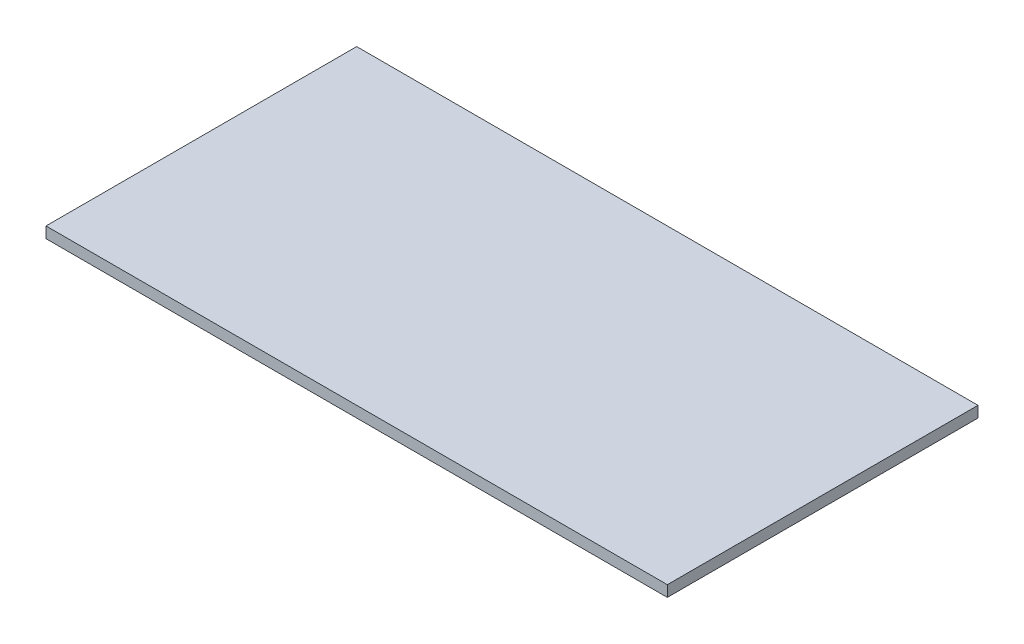
ISO-10303-21;
HEADER;
FILE_DESCRIPTION(('STEP AP214'),'2;1');
FILE_NAME('part.step','',(''),(''),'','','');
FILE_SCHEMA(('AUTOMOTIVE_DESIGN { 1 0 10303 214 1 1 1 1 }'));
ENDSEC;
DATA;
#1=APPLICATION_CONTEXT('core data for automotive mechanical design processes');
#2=APPLICATION_PROTOCOL_DEFINITION('international standard','automotive_design',2000,#1);
#3=PRODUCT_CONTEXT('',#1,'mechanical');
#4=PRODUCT('Part','Part','',(#3));
#5=PRODUCT_RELATED_PRODUCT_CATEGORY('part','',(#4));
#6=PRODUCT_DEFINITION_FORMATION('','',#4);
#7=PRODUCT_DEFINITION_CONTEXT('part definition',#1,'design');
#8=PRODUCT_DEFINITION('design','',#6,#7);
#9=PRODUCT_DEFINITION_SHAPE('','',#8);
#10=(LENGTH_UNIT() NAMED_UNIT(*) SI_UNIT(.MILLI.,.METRE.));
#11=(NAMED_UNIT(*) PLANE_ANGLE_UNIT() SI_UNIT($,.RADIAN.));
#12=(NAMED_UNIT(*) SI_UNIT($,.STERADIAN.) SOLID_ANGLE_UNIT());
#13=UNCERTAINTY_MEASURE_WITH_UNIT(LENGTH_MEASURE(1.E-05),#10,'distance_accuracy_value','');
#14=(GEOMETRIC_REPRESENTATION_CONTEXT(3) GLOBAL_UNCERTAINTY_ASSIGNED_CONTEXT((#13)) GLOBAL_UNIT_ASSIGNED_CONTEXT((#10,
#11,#12)) REPRESENTATION_CONTEXT('',''));
#15=CARTESIAN_POINT('',(0.,0.,0.));
#16=DIRECTION('',(0.,0.,1.));
#17=DIRECTION('',(1.,0.,0.));
#18=AXIS2_PLACEMENT_3D('',#15,#16,#17);
#19=CARTESIAN_POINT('',(-38.5060975609756,1.6,-20.2134146341463));
#20=DIRECTION('',(1.,0.,0.));
#21=DIRECTION('',(0.,0.,-1.));
#22=AXIS2_PLACEMENT_3D('',#19,#20,#21);
#23=PLANE('',#22);
#24=DIRECTION('',(0.,0.,1.));
#25=VECTOR('',#24,1.);
#26=CARTESIAN_POINT('',(-38.5060975609756,0.,-20.2134146341463));
#27=LINE('',#26,#25);
#28=CARTESIAN_POINT('',(-38.5060975609756,0.,-20.2134146341463));
#29=VERTEX_POINT('',#28);
#30=CARTESIAN_POINT('',(-38.5060975609756,0.,24.7865853658537));
#31=VERTEX_POINT('',#30);
#32=EDGE_CURVE('E98',#29,#31,#27,.T.);
#33=ORIENTED_EDGE('',*,*,#32,.T.);
#34=DIRECTION('',(0.,-1.,0.));
#35=VECTOR('',#34,1.);
#36=CARTESIAN_POINT('',(-38.5060975609756,1.6,24.7865853658537));
#37=LINE('',#36,#35);
#38=CARTESIAN_POINT('',(-38.5060975609756,1.6,24.7865853658537));
#39=VERTEX_POINT('',#38);
#40=EDGE_CURVE('E11',#39,#31,#37,.T.);
#41=ORIENTED_EDGE('',*,*,#40,.F.);
#42=DIRECTION('',(0.,0.,1.));
#43=VECTOR('',#42,1.);
#44=CARTESIAN_POINT('',(-38.5060975609756,1.6,-20.2134146341463));
#45=LINE('',#44,#43);
#46=CARTESIAN_POINT('',(-38.5060975609756,1.6,-20.2134146341463));
#47=VERTEX_POINT('',#46);
#48=EDGE_CURVE('E86',#47,#39,#45,.T.);
#49=ORIENTED_EDGE('',*,*,#48,.F.);
#50=DIRECTION('',(0.,-1.,0.));
#51=VECTOR('',#50,1.);
#52=CARTESIAN_POINT('',(-38.5060975609756,1.6,-20.2134146341463));
#53=LINE('',#52,#51);
#54=EDGE_CURVE('E94',#47,#29,#53,.T.);
#55=ORIENTED_EDGE('',*,*,#54,.T.);
#56=EDGE_LOOP('',(#33,#41,#49,#55));
#57=FACE_BOUND('',#56,.T.);
#58=ADVANCED_FACE('F35',(#57),#23,.F.);
#59=CARTESIAN_POINT('',(-38.5060975609756,1.6,24.7865853658537));
#60=DIRECTION('',(0.,0.,-1.));
#61=DIRECTION('',(-1.,0.,0.));
#62=AXIS2_PLACEMENT_3D('',#59,#60,#61);
#63=PLANE('',#62);
#64=DIRECTION('',(1.,0.,0.));
#65=VECTOR('',#64,1.);
#66=CARTESIAN_POINT('',(-38.5060975609756,0.,24.7865853658537));
#67=LINE('',#66,#65);
#68=CARTESIAN_POINT('',(51.4939024390244,0.,24.7865853658537));
#69=VERTEX_POINT('',#68);
#70=EDGE_CURVE('E90',#31,#69,#67,.T.);
#71=ORIENTED_EDGE('',*,*,#70,.T.);
#72=DIRECTION('',(0.,-1.,0.));
#73=VECTOR('',#72,1.);
#74=CARTESIAN_POINT('',(51.4939024390244,1.6,24.7865853658537));
#75=LINE('',#74,#73);
#76=CARTESIAN_POINT('',(51.4939024390244,1.6,24.7865853658537));
#77=VERTEX_POINT('',#76);
#78=EDGE_CURVE('E43',#77,#69,#75,.T.);
#79=ORIENTED_EDGE('',*,*,#78,.F.);
#80=DIRECTION('',(1.,0.,0.));
#81=VECTOR('',#80,1.);
#82=CARTESIAN_POINT('',(-38.5060975609756,1.6,24.7865853658537));
#83=LINE('',#82,#81);
#84=EDGE_CURVE('E81',#39,#77,#83,.T.);
#85=ORIENTED_EDGE('',*,*,#84,.F.);
#86=ORIENTED_EDGE('',*,*,#40,.T.);
#87=EDGE_LOOP('',(#71,#79,#85,#86));
#88=FACE_BOUND('',#87,.T.);
#89=ADVANCED_FACE('F89',(#88),#63,.F.);
#90=CARTESIAN_POINT('',(51.4939024390244,1.6,-20.2134146341463));
#91=DIRECTION('',(-1.,0.,0.));
#92=DIRECTION('',(0.,0.,1.));
#93=AXIS2_PLACEMENT_3D('',#90,#91,#92);
#94=PLANE('',#93);
#95=DIRECTION('',(0.,0.,-1.));
#96=VECTOR('',#95,1.);
#97=CARTESIAN_POINT('',(51.4939024390244,0.,-20.2134146341463));
#98=LINE('',#97,#96);
#99=CARTESIAN_POINT('',(51.4939024390244,0.,-20.2134146341463));
#100=VERTEX_POINT('',#99);
#101=EDGE_CURVE('E68',#69,#100,#98,.T.);
#102=ORIENTED_EDGE('',*,*,#101,.T.);
#103=DIRECTION('',(0.,-1.,0.));
#104=VECTOR('',#103,1.);
#105=CARTESIAN_POINT('',(51.4939024390244,1.6,-20.2134146341463));
#106=LINE('',#105,#104);
#107=CARTESIAN_POINT('',(51.4939024390244,1.6,-20.2134146341463));
#108=VERTEX_POINT('',#107);
#109=EDGE_CURVE('E91',#108,#100,#106,.T.);
#110=ORIENTED_EDGE('',*,*,#109,.F.);
#111=DIRECTION('',(0.,0.,-1.));
#112=VECTOR('',#111,1.);
#113=CARTESIAN_POINT('',(51.4939024390244,1.6,-20.2134146341463));
#114=LINE('',#113,#112);
#115=EDGE_CURVE('E84',#77,#108,#114,.T.);
#116=ORIENTED_EDGE('',*,*,#115,.F.);
#117=ORIENTED_EDGE('',*,*,#78,.T.);
#118=EDGE_LOOP('',(#102,#110,#116,#117));
#119=FACE_BOUND('',#118,.T.);
#120=ADVANCED_FACE('F92',(#119),#94,.F.);
#121=CARTESIAN_POINT('',(-38.5060975609756,1.6,-20.2134146341463));
#122=DIRECTION('',(0.,0.,1.));
#123=DIRECTION('',(1.,0.,0.));
#124=AXIS2_PLACEMENT_3D('',#121,#122,#123);
#125=PLANE('',#124);
#126=DIRECTION('',(-1.,0.,0.));
#127=VECTOR('',#126,1.);
#128=CARTESIAN_POINT('',(-38.5060975609756,0.,-20.2134146341463));
#129=LINE('',#128,#127);
#130=EDGE_CURVE('E74',#100,#29,#129,.T.);
#131=ORIENTED_EDGE('',*,*,#130,.T.);
#132=ORIENTED_EDGE('',*,*,#54,.F.);
#133=DIRECTION('',(-1.,0.,0.));
#134=VECTOR('',#133,1.);
#135=CARTESIAN_POINT('',(-38.5060975609756,1.6,-20.2134146341463));
#136=LINE('',#135,#134);
#137=EDGE_CURVE('E51',#108,#47,#136,.T.);
#138=ORIENTED_EDGE('',*,*,#137,.F.);
#139=ORIENTED_EDGE('',*,*,#109,.T.);
#140=EDGE_LOOP('',(#131,#132,#138,#139));
#141=FACE_BOUND('',#140,.T.);
#142=ADVANCED_FACE('F105',(#141),#125,.F.);
#143=CARTESIAN_POINT('',(0.,1.6,0.));
#144=DIRECTION('',(0.,1.,0.));
#145=DIRECTION('',(0.,0.,1.));
#146=AXIS2_PLACEMENT_3D('',#143,#144,#145);
#147=PLANE('',#146);
#148=ORIENTED_EDGE('',*,*,#48,.T.);
#149=ORIENTED_EDGE('',*,*,#84,.T.);
#150=ORIENTED_EDGE('',*,*,#115,.T.);
#151=ORIENTED_EDGE('',*,*,#137,.T.);
#152=EDGE_LOOP('',(#148,#149,#150,#151));
#153=FACE_BOUND('',#152,.T.);
#154=ADVANCED_FACE('F82',(#153),#147,.T.);
#155=CARTESIAN_POINT('',(0.,0.,0.));
#156=DIRECTION('',(0.,1.,0.));
#157=DIRECTION('',(0.,0.,1.));
#158=AXIS2_PLACEMENT_3D('',#155,#156,#157);
#159=PLANE('',#158);
#160=ORIENTED_EDGE('',*,*,#32,.F.);
#161=ORIENTED_EDGE('',*,*,#130,.F.);
#162=ORIENTED_EDGE('',*,*,#101,.F.);
#163=ORIENTED_EDGE('',*,*,#70,.F.);
#164=EDGE_LOOP('',(#160,#161,#162,#163));
#165=FACE_BOUND('',#164,.T.);
#166=ADVANCED_FACE('F108',(#165),#159,.F.);
#167=CLOSED_SHELL('',(#58,#89,#120,#142,#154,#166));
#168=MANIFOLD_SOLID_BREP('B2',#167);
#169=ADVANCED_BREP_SHAPE_REPRESENTATION('',(#18,#168),#14);
#170=SHAPE_DEFINITION_REPRESENTATION(#9,#169);
ENDSEC;
END-ISO-10303-21;
